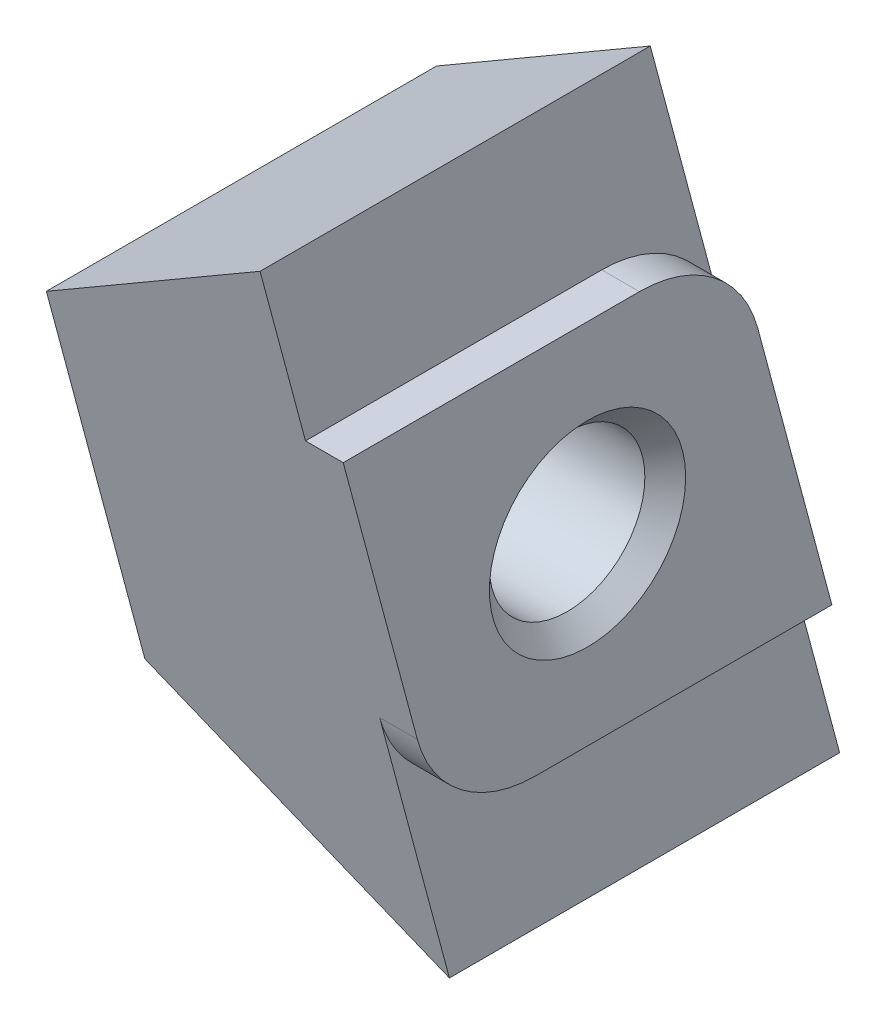
ISO-10303-21;
HEADER;
FILE_DESCRIPTION(('STEP AP214'),'2;1');
FILE_NAME('part.step','',(''),(''),'','','');
FILE_SCHEMA(('AUTOMOTIVE_DESIGN { 1 0 10303 214 1 1 1 1 }'));
ENDSEC;
DATA;
#1=APPLICATION_CONTEXT('core data for automotive mechanical design processes');
#2=APPLICATION_PROTOCOL_DEFINITION('international standard','automotive_design',2000,#1);
#3=PRODUCT_CONTEXT('',#1,'mechanical');
#4=PRODUCT('Part','Part','',(#3));
#5=PRODUCT_RELATED_PRODUCT_CATEGORY('part','',(#4));
#6=PRODUCT_DEFINITION_FORMATION('','',#4);
#7=PRODUCT_DEFINITION_CONTEXT('part definition',#1,'design');
#8=PRODUCT_DEFINITION('design','',#6,#7);
#9=PRODUCT_DEFINITION_SHAPE('','',#8);
#10=(LENGTH_UNIT() NAMED_UNIT(*) SI_UNIT(.MILLI.,.METRE.));
#11=(NAMED_UNIT(*) PLANE_ANGLE_UNIT() SI_UNIT($,.RADIAN.));
#12=(NAMED_UNIT(*) SI_UNIT($,.STERADIAN.) SOLID_ANGLE_UNIT());
#13=UNCERTAINTY_MEASURE_WITH_UNIT(LENGTH_MEASURE(1.E-05),#10,'distance_accuracy_value','');
#14=(GEOMETRIC_REPRESENTATION_CONTEXT(3) GLOBAL_UNCERTAINTY_ASSIGNED_CONTEXT((#13)) GLOBAL_UNIT_ASSIGNED_CONTEXT((#10,
#11,#12)) REPRESENTATION_CONTEXT('',''));
#15=CARTESIAN_POINT('',(0.,0.,0.));
#16=DIRECTION('',(0.,0.,1.));
#17=DIRECTION('',(1.,0.,0.));
#18=AXIS2_PLACEMENT_3D('',#15,#16,#17);
#19=CARTESIAN_POINT('',(-0.800000000000001,1.29999999999999,-1.10105270241365));
#20=DIRECTION('',(1.,0.,0.));
#21=DIRECTION('',(0.,0.,-1.));
#22=AXIS2_PLACEMENT_3D('',#19,#20,#21);
#23=CYLINDRICAL_SURFACE('',#22,2.60000000000001);
#24=CARTESIAN_POINT('',(0.,1.29999999999999,-1.10105270241365));
#25=DIRECTION('',(1.,0.,0.));
#26=DIRECTION('',(0.,0.,-1.));
#27=AXIS2_PLACEMENT_3D('',#24,#25,#26);
#28=CIRCLE('',#27,2.60000000000001);
#29=CARTESIAN_POINT('',(0.,1.97292951726655,-3.61245985076524));
#30=VERTEX_POINT('',#29);
#31=CARTESIAN_POINT('',(0.,3.9,-1.10105270241365));
#32=VERTEX_POINT('',#31);
#33=EDGE_CURVE('E152',#30,#32,#28,.T.);
#34=ORIENTED_EDGE('',*,*,#33,.F.);
#35=DIRECTION('',(1.,0.,0.));
#36=VECTOR('',#35,1.);
#37=CARTESIAN_POINT('',(-0.800000000000001,1.97292951726655,-3.61245985076524));
#38=LINE('',#37,#36);
#39=CARTESIAN_POINT('',(-0.800000000000001,1.97292951726655,-3.61245985076523));
#40=VERTEX_POINT('',#39);
#41=EDGE_CURVE('E170',#40,#30,#38,.T.);
#42=ORIENTED_EDGE('',*,*,#41,.F.);
#43=CARTESIAN_POINT('',(-0.800000000000001,1.29999999999999,-1.10105270241365));
#44=DIRECTION('',(1.,0.,0.));
#45=DIRECTION('',(0.,0.,-1.));
#46=AXIS2_PLACEMENT_3D('',#43,#44,#45);
#47=CIRCLE('',#46,2.60000000000001);
#48=CARTESIAN_POINT('',(-0.800000000000001,3.9,-1.10105270241365));
#49=VERTEX_POINT('',#48);
#50=EDGE_CURVE('E138',#40,#49,#47,.T.);
#51=ORIENTED_EDGE('',*,*,#50,.T.);
#52=DIRECTION('',(1.,0.,0.));
#53=VECTOR('',#52,1.);
#54=CARTESIAN_POINT('',(-0.800000000000001,3.9,-1.10105270241365));
#55=LINE('',#54,#53);
#56=EDGE_CURVE('E122',#49,#32,#55,.T.);
#57=ORIENTED_EDGE('',*,*,#56,.T.);
#58=EDGE_LOOP('',(#34,#42,#51,#57));
#59=FACE_BOUND('',#58,.T.);
#60=ADVANCED_FACE('F35',(#59),#23,.T.);
#61=CARTESIAN_POINT('',(-0.800000000000001,-3.9,-5.18610657212171));
#62=DIRECTION('',(0.,0.25881904510252,-0.965925826289068));
#63=DIRECTION('',(0.,0.965925826289068,0.25881904510252));
#64=AXIS2_PLACEMENT_3D('',#61,#62,#63);
#65=PLANE('',#64);
#66=DIRECTION('',(0.,0.965925826289068,0.25881904510252));
#67=VECTOR('',#66,1.);
#68=CARTESIAN_POINT('',(0.,-3.9,-5.18610657212171));
#69=LINE('',#68,#67);
#70=CARTESIAN_POINT('',(0.,-3.9,-5.18610657212171));
#71=VERTEX_POINT('',#70);
#72=EDGE_CURVE('E276',#71,#30,#69,.T.);
#73=ORIENTED_EDGE('',*,*,#72,.F.);
#74=DIRECTION('',(1.,0.,0.));
#75=VECTOR('',#74,1.);
#76=CARTESIAN_POINT('',(-0.800000000000001,-3.9,-5.18610657212171));
#77=LINE('',#76,#75);
#78=CARTESIAN_POINT('',(-0.800000000000001,-3.9,-5.18610657212171));
#79=VERTEX_POINT('',#78);
#80=EDGE_CURVE('E132',#79,#71,#77,.T.);
#81=ORIENTED_EDGE('',*,*,#80,.F.);
#82=CARTESIAN_POINT('',(-0.800000000000001,7.5,-2.13148577840691));
#83=CARTESIAN_POINT('',(-0.800000000000001,2.5,-3.47123174056252));
#84=CARTESIAN_POINT('',(-0.800000000000001,-2.5,-4.81097770271814));
#85=CARTESIAN_POINT('',(-0.800000000000001,-7.5,-6.15072366487375));
#86=B_SPLINE_CURVE_WITH_KNOTS('',3,(#82,#83,#84,#85),.UNSPECIFIED.,.F.,.F.,(4,4),(0.,1.),.UNSPECIFIED.);
#87=CARTESIAN_POINT('',(-0.800000000000001,-7.5,-6.15072366487375));
#88=VERTEX_POINT('',#87);
#89=EDGE_CURVE('E119',#79,#88,#86,.T.);
#90=ORIENTED_EDGE('',*,*,#89,.T.);
#91=DIRECTION('',(-0.827835666345006,0.541856072516727,0.145189897044757));
#92=VECTOR('',#91,1.);
#93=CARTESIAN_POINT('',(-2.53078460239917,-6.36712280570237,-5.84717013553806));
#94=LINE('',#93,#92);
#95=CARTESIAN_POINT('',(-6.3,-3.90000000000003,-5.18610657212172));
#96=VERTEX_POINT('',#95);
#97=EDGE_CURVE('E159',#96,#88,#94,.F.);
#98=ORIENTED_EDGE('',*,*,#97,.F.);
#99=CARTESIAN_POINT('',(-6.3,7.5,-2.13148577840691));
#100=CARTESIAN_POINT('',(-6.3,2.5,-3.47123174056252));
#101=CARTESIAN_POINT('',(-6.3,-2.5,-4.81097770271814));
#102=CARTESIAN_POINT('',(-6.3,-7.5,-6.15072366487375));
#103=B_SPLINE_CURVE_WITH_KNOTS('',3,(#99,#100,#101,#102),.UNSPECIFIED.,.F.,.F.,(4,4),(0.,1.),.UNSPECIFIED.);
#104=CARTESIAN_POINT('',(-6.3,3.90000000000003,-3.09610287115894));
#105=VERTEX_POINT('',#104);
#106=EDGE_CURVE('E86',#105,#96,#103,.T.);
#107=ORIENTED_EDGE('',*,*,#106,.F.);
#108=DIRECTION('',(-0.827835666345006,-0.541856072516727,-0.145189897044757));
#109=VECTOR('',#108,1.);
#110=CARTESIAN_POINT('',(-0.8,7.5,-2.13148577840691));
#111=LINE('',#110,#109);
#112=CARTESIAN_POINT('',(-0.800000000000001,7.5,-2.13148577840691));
#113=VERTEX_POINT('',#112);
#114=EDGE_CURVE('E153',#105,#113,#111,.F.);
#115=ORIENTED_EDGE('',*,*,#114,.T.);
#116=EDGE_CURVE('E226',#113,#40,#86,.T.);
#117=ORIENTED_EDGE('',*,*,#116,.T.);
#118=ORIENTED_EDGE('',*,*,#41,.T.);
#119=EDGE_LOOP('',(#73,#81,#90,#98,#107,#115,#117,#118));
#120=FACE_BOUND('',#119,.T.);
#121=ADVANCED_FACE('F196',(#120),#65,.T.);
#122=CARTESIAN_POINT('',(-0.800000000000001,-3.9,1.10105270241365));
#123=DIRECTION('',(0.,-1.,0.));
#124=DIRECTION('',(0.,0.,-1.));
#125=AXIS2_PLACEMENT_3D('',#122,#123,#124);
#126=PLANE('',#125);
#127=DIRECTION('',(0.,0.,-1.));
#128=VECTOR('',#127,1.);
#129=CARTESIAN_POINT('',(0.,-3.9,1.10105270241365));
#130=LINE('',#129,#128);
#131=CARTESIAN_POINT('',(0.,-3.9,1.10105270241365));
#132=VERTEX_POINT('',#131);
#133=EDGE_CURVE('E128',#132,#71,#130,.T.);
#134=ORIENTED_EDGE('',*,*,#133,.F.);
#135=DIRECTION('',(1.,0.,0.));
#136=VECTOR('',#135,1.);
#137=CARTESIAN_POINT('',(-0.800000000000001,-3.9,1.10105270241365));
#138=LINE('',#137,#136);
#139=CARTESIAN_POINT('',(-0.800000000000001,-3.9,1.10105270241365));
#140=VERTEX_POINT('',#139);
#141=EDGE_CURVE('E125',#140,#132,#138,.T.);
#142=ORIENTED_EDGE('',*,*,#141,.F.);
#143=DIRECTION('',(0.,0.,-1.));
#144=VECTOR('',#143,1.);
#145=CARTESIAN_POINT('',(-0.800000000000001,-3.9,1.10105270241365));
#146=LINE('',#145,#144);
#147=EDGE_CURVE('E114',#140,#79,#146,.T.);
#148=ORIENTED_EDGE('',*,*,#147,.T.);
#149=ORIENTED_EDGE('',*,*,#80,.T.);
#150=EDGE_LOOP('',(#134,#142,#148,#149));
#151=FACE_BOUND('',#150,.T.);
#152=ADVANCED_FACE('F126',(#151),#126,.T.);
#153=CARTESIAN_POINT('',(-0.800000000000001,-1.3,1.10105270241365));
#154=DIRECTION('',(1.,0.,0.));
#155=DIRECTION('',(0.,0.,-1.));
#156=AXIS2_PLACEMENT_3D('',#153,#154,#155);
#157=CYLINDRICAL_SURFACE('',#156,2.6);
#158=CARTESIAN_POINT('',(0.,-1.3,1.10105270241365));
#159=DIRECTION('',(1.,0.,0.));
#160=DIRECTION('',(0.,0.,-1.));
#161=AXIS2_PLACEMENT_3D('',#158,#159,#160);
#162=CIRCLE('',#161,2.6);
#163=CARTESIAN_POINT('',(0.,-1.97292951726655,3.61245985076523));
#164=VERTEX_POINT('',#163);
#165=EDGE_CURVE('E290',#164,#132,#162,.T.);
#166=ORIENTED_EDGE('',*,*,#165,.F.);
#167=DIRECTION('',(1.,0.,0.));
#168=VECTOR('',#167,1.);
#169=CARTESIAN_POINT('',(-0.800000000000001,-1.97292951726655,3.61245985076523));
#170=LINE('',#169,#168);
#171=CARTESIAN_POINT('',(-0.800000000000001,-1.97292951726656,3.61245985076523));
#172=VERTEX_POINT('',#171);
#173=EDGE_CURVE('E133',#172,#164,#170,.T.);
#174=ORIENTED_EDGE('',*,*,#173,.F.);
#175=CARTESIAN_POINT('',(-0.800000000000001,-1.3,1.10105270241365));
#176=DIRECTION('',(1.,0.,0.));
#177=DIRECTION('',(0.,0.,-1.));
#178=AXIS2_PLACEMENT_3D('',#175,#176,#177);
#179=CIRCLE('',#178,2.6);
#180=EDGE_CURVE('E100',#172,#140,#179,.T.);
#181=ORIENTED_EDGE('',*,*,#180,.T.);
#182=ORIENTED_EDGE('',*,*,#141,.T.);
#183=EDGE_LOOP('',(#166,#174,#181,#182));
#184=FACE_BOUND('',#183,.T.);
#185=ADVANCED_FACE('F136',(#184),#157,.T.);
#186=CARTESIAN_POINT('',(-0.800000000000001,3.9,5.18610657212171));
#187=DIRECTION('',(0.,-0.258819045102521,0.965925826289068));
#188=DIRECTION('',(0.,-0.965925826289068,-0.258819045102521));
#189=AXIS2_PLACEMENT_3D('',#186,#187,#188);
#190=PLANE('',#189);
#191=DIRECTION('',(0.,-0.965925826289068,-0.258819045102521));
#192=VECTOR('',#191,1.);
#193=CARTESIAN_POINT('',(0.,3.9,5.18610657212171));
#194=LINE('',#193,#192);
#195=CARTESIAN_POINT('',(0.,3.9,5.18610657212171));
#196=VERTEX_POINT('',#195);
#197=EDGE_CURVE('E296',#196,#164,#194,.T.);
#198=ORIENTED_EDGE('',*,*,#197,.F.);
#199=DIRECTION('',(1.,0.,0.));
#200=VECTOR('',#199,1.);
#201=CARTESIAN_POINT('',(-0.800000000000001,3.9,5.18610657212171));
#202=LINE('',#201,#200);
#203=CARTESIAN_POINT('',(-0.800000000000001,3.9,5.18610657212171));
#204=VERTEX_POINT('',#203);
#205=EDGE_CURVE('E146',#204,#196,#202,.T.);
#206=ORIENTED_EDGE('',*,*,#205,.F.);
#207=CARTESIAN_POINT('',(-0.800000000000001,-7.5,2.13148577840691));
#208=CARTESIAN_POINT('',(-0.800000000000001,-2.5,3.47123174056252));
#209=CARTESIAN_POINT('',(-0.800000000000001,2.5,4.81097770271814));
#210=CARTESIAN_POINT('',(-0.800000000000001,7.5,6.15072366487375));
#211=B_SPLINE_CURVE_WITH_KNOTS('',3,(#207,#208,#209,#210),.UNSPECIFIED.,.F.,.F.,(4,4),(0.,1.),.UNSPECIFIED.);
#212=CARTESIAN_POINT('',(-0.800000000000001,7.5,6.15072366487375));
#213=VERTEX_POINT('',#212);
#214=EDGE_CURVE('E52',#204,#213,#211,.T.);
#215=ORIENTED_EDGE('',*,*,#214,.T.);
#216=DIRECTION('',(-0.827835666345006,-0.541856072516727,-0.145189897044757));
#217=VECTOR('',#216,1.);
#218=CARTESIAN_POINT('',(-2.53078460239917,6.36712280570237,5.84717013553807));
#219=LINE('',#218,#217);
#220=CARTESIAN_POINT('',(-6.3,3.90000000000003,5.18610657212172));
#221=VERTEX_POINT('',#220);
#222=EDGE_CURVE('E149',#221,#213,#219,.F.);
#223=ORIENTED_EDGE('',*,*,#222,.F.);
#224=CARTESIAN_POINT('',(-6.3,-7.5,2.13148577840691));
#225=CARTESIAN_POINT('',(-6.3,-2.5,3.47123174056252));
#226=CARTESIAN_POINT('',(-6.3,2.5,4.81097770271814));
#227=CARTESIAN_POINT('',(-6.3,7.5,6.15072366487375));
#228=B_SPLINE_CURVE_WITH_KNOTS('',3,(#224,#225,#226,#227),.UNSPECIFIED.,.F.,.F.,(4,4),(0.,1.),.UNSPECIFIED.);
#229=CARTESIAN_POINT('',(-6.3,-3.90000000000003,3.09610287115894));
#230=VERTEX_POINT('',#229);
#231=EDGE_CURVE('E156',#230,#221,#228,.T.);
#232=ORIENTED_EDGE('',*,*,#231,.F.);
#233=DIRECTION('',(-0.827835666345006,0.541856072516727,0.145189897044757));
#234=VECTOR('',#233,1.);
#235=CARTESIAN_POINT('',(-0.800000000000001,-7.5,2.1314857784069));
#236=LINE('',#235,#234);
#237=CARTESIAN_POINT('',(-0.800000000000001,-7.5,2.13148577840691));
#238=VERTEX_POINT('',#237);
#239=EDGE_CURVE('E162',#230,#238,#236,.F.);
#240=ORIENTED_EDGE('',*,*,#239,.T.);
#241=EDGE_CURVE('E231',#238,#172,#211,.T.);
#242=ORIENTED_EDGE('',*,*,#241,.T.);
#243=ORIENTED_EDGE('',*,*,#173,.T.);
#244=EDGE_LOOP('',(#198,#206,#215,#223,#232,#240,#242,#243));
#245=FACE_BOUND('',#244,.T.);
#246=ADVANCED_FACE('F230',(#245),#190,.T.);
#247=CARTESIAN_POINT('',(-0.800000000000001,3.9,-1.10105270241365));
#248=DIRECTION('',(0.,1.,0.));
#249=DIRECTION('',(0.,0.,1.));
#250=AXIS2_PLACEMENT_3D('',#247,#248,#249);
#251=PLANE('',#250);
#252=DIRECTION('',(0.,0.,1.));
#253=VECTOR('',#252,1.);
#254=CARTESIAN_POINT('',(0.,3.9,-1.10105270241365));
#255=LINE('',#254,#253);
#256=EDGE_CURVE('E294',#32,#196,#255,.T.);
#257=ORIENTED_EDGE('',*,*,#256,.F.);
#258=ORIENTED_EDGE('',*,*,#56,.F.);
#259=DIRECTION('',(0.,0.,1.));
#260=VECTOR('',#259,1.);
#261=CARTESIAN_POINT('',(-0.800000000000001,3.9,-1.10105270241365));
#262=LINE('',#261,#260);
#263=EDGE_CURVE('E111',#49,#204,#262,.T.);
#264=ORIENTED_EDGE('',*,*,#263,.T.);
#265=ORIENTED_EDGE('',*,*,#205,.T.);
#266=EDGE_LOOP('',(#257,#258,#264,#265));
#267=FACE_BOUND('',#266,.T.);
#268=ADVANCED_FACE('F207',(#267),#251,.T.);
#269=CARTESIAN_POINT('',(0.,1.29999999999999,-1.10105270241365));
#270=DIRECTION('',(1.,0.,0.));
#271=DIRECTION('',(0.,0.,-1.));
#272=AXIS2_PLACEMENT_3D('',#269,#270,#271);
#273=PLANE('',#272);
#274=CARTESIAN_POINT('',(0.,0.,0.));
#275=DIRECTION('',(1.,0.,0.));
#276=DIRECTION('',(0.,0.,-1.));
#277=AXIS2_PLACEMENT_3D('',#274,#275,#276);
#278=CIRCLE('',#277,2.08299999999966);
#279=CARTESIAN_POINT('',(0.,0.,-2.08299999999966));
#280=VERTEX_POINT('',#279);
#281=EDGE_CURVE('E44',#280,#280,#278,.F.);
#282=ORIENTED_EDGE('',*,*,#281,.T.);
#283=EDGE_LOOP('',(#282));
#284=FACE_BOUND('',#283,.T.);
#285=ORIENTED_EDGE('',*,*,#33,.T.);
#286=ORIENTED_EDGE('',*,*,#256,.T.);
#287=ORIENTED_EDGE('',*,*,#197,.T.);
#288=ORIENTED_EDGE('',*,*,#165,.T.);
#289=ORIENTED_EDGE('',*,*,#133,.T.);
#290=ORIENTED_EDGE('',*,*,#72,.T.);
#291=EDGE_LOOP('',(#285,#286,#287,#288,#289,#290));
#292=FACE_BOUND('',#291,.T.);
#293=ADVANCED_FACE('F175',(#284,#292),#273,.T.);
#294=CARTESIAN_POINT('',(-0.800000000000001,0.,4.14110472164033));
#295=DIRECTION('',(-1.,0.,0.));
#296=DIRECTION('',(0.,0.,1.));
#297=AXIS2_PLACEMENT_3D('',#294,#295,#296);
#298=PLANE('',#297);
#299=ORIENTED_EDGE('',*,*,#147,.F.);
#300=ORIENTED_EDGE('',*,*,#180,.F.);
#301=ORIENTED_EDGE('',*,*,#241,.F.);
#302=DIRECTION('',(0.,0.,1.));
#303=VECTOR('',#302,1.);
#304=CARTESIAN_POINT('',(-0.800000000000001,-7.5,2.13148577840691));
#305=LINE('',#304,#303);
#306=EDGE_CURVE('E223',#88,#238,#305,.T.);
#307=ORIENTED_EDGE('',*,*,#306,.F.);
#308=ORIENTED_EDGE('',*,*,#89,.F.);
#309=EDGE_LOOP('',(#299,#300,#301,#307,#308));
#310=FACE_BOUND('',#309,.T.);
#311=ADVANCED_FACE('F116',(#310),#298,.F.);
#312=CARTESIAN_POINT('',(-0.800000000000001,7.5,-2.13148577840691));
#313=DIRECTION('',(-0.547659174694385,0.836701516894206,0.));
#314=DIRECTION('',(-0.836701516894206,-0.547659174694385,0.));
#315=AXIS2_PLACEMENT_3D('',#312,#313,#314);
#316=PLANE('',#315);
#317=DIRECTION('',(0.,0.,-1.));
#318=VECTOR('',#317,1.);
#319=CARTESIAN_POINT('',(-0.800000000000001,7.5,-2.13148577840691));
#320=LINE('',#319,#318);
#321=EDGE_CURVE('E233',#213,#113,#320,.T.);
#322=ORIENTED_EDGE('',*,*,#321,.T.);
#323=ORIENTED_EDGE('',*,*,#114,.F.);
#324=DIRECTION('',(0.,0.,1.));
#325=VECTOR('',#324,1.);
#326=CARTESIAN_POINT('',(-6.3,3.90000000000003,-2.13148577840691));
#327=LINE('',#326,#325);
#328=EDGE_CURVE('E154',#221,#105,#327,.F.);
#329=ORIENTED_EDGE('',*,*,#328,.F.);
#330=ORIENTED_EDGE('',*,*,#222,.T.);
#331=EDGE_LOOP('',(#322,#323,#329,#330));
#332=FACE_BOUND('',#331,.T.);
#333=ADVANCED_FACE('F209',(#332),#316,.T.);
#334=CARTESIAN_POINT('',(-0.800000000000001,-7.5,2.13148577840691));
#335=DIRECTION('',(-0.547659174694385,-0.836701516894206,0.));
#336=DIRECTION('',(0.836701516894206,-0.547659174694385,0.));
#337=AXIS2_PLACEMENT_3D('',#334,#335,#336);
#338=PLANE('',#337);
#339=ORIENTED_EDGE('',*,*,#306,.T.);
#340=ORIENTED_EDGE('',*,*,#239,.F.);
#341=DIRECTION('',(0.,0.,-1.));
#342=VECTOR('',#341,1.);
#343=CARTESIAN_POINT('',(-6.3,-3.90000000000003,2.13148577840691));
#344=LINE('',#343,#342);
#345=EDGE_CURVE('E91',#96,#230,#344,.F.);
#346=ORIENTED_EDGE('',*,*,#345,.F.);
#347=ORIENTED_EDGE('',*,*,#97,.T.);
#348=EDGE_LOOP('',(#339,#340,#346,#347));
#349=FACE_BOUND('',#348,.T.);
#350=ADVANCED_FACE('F212',(#349),#338,.T.);
#351=CARTESIAN_POINT('',(-6.3,0.,4.14110472164033));
#352=DIRECTION('',(-1.,0.,0.));
#353=DIRECTION('',(0.,0.,1.));
#354=AXIS2_PLACEMENT_3D('',#351,#352,#353);
#355=PLANE('',#354);
#356=CARTESIAN_POINT('',(-6.3,0.,0.));
#357=DIRECTION('',(-1.,0.,0.));
#358=DIRECTION('',(0.,0.,1.));
#359=AXIS2_PLACEMENT_3D('',#356,#357,#358);
#360=CIRCLE('',#359,2.08299999999966);
#361=CARTESIAN_POINT('',(-6.3,0.,2.08299999999966));
#362=VERTEX_POINT('',#361);
#363=EDGE_CURVE('E11',#362,#362,#360,.F.);
#364=ORIENTED_EDGE('',*,*,#363,.T.);
#365=EDGE_LOOP('',(#364));
#366=FACE_BOUND('',#365,.T.);
#367=ORIENTED_EDGE('',*,*,#231,.T.);
#368=ORIENTED_EDGE('',*,*,#328,.T.);
#369=ORIENTED_EDGE('',*,*,#106,.T.);
#370=ORIENTED_EDGE('',*,*,#345,.T.);
#371=EDGE_LOOP('',(#367,#368,#369,#370));
#372=FACE_BOUND('',#371,.T.);
#373=ADVANCED_FACE('F215',(#366,#372),#355,.T.);
#374=ORIENTED_EDGE('',*,*,#50,.F.);
#375=ORIENTED_EDGE('',*,*,#116,.F.);
#376=ORIENTED_EDGE('',*,*,#321,.F.);
#377=ORIENTED_EDGE('',*,*,#214,.F.);
#378=ORIENTED_EDGE('',*,*,#263,.F.);
#379=EDGE_LOOP('',(#374,#375,#376,#377,#378));
#380=FACE_BOUND('',#379,.T.);
#381=ADVANCED_FACE('F186',(#380),#298,.F.);
#382=CARTESIAN_POINT('',(-6.3,0.,0.));
#383=DIRECTION('',(-1.,0.,0.));
#384=DIRECTION('',(0.,0.,1.));
#385=AXIS2_PLACEMENT_3D('',#382,#383,#384);
#386=CYLINDRICAL_SURFACE('',#385,1.65);
#387=CARTESIAN_POINT('',(-0.43299999999966,0.,0.));
#388=DIRECTION('',(1.,0.,0.));
#389=DIRECTION('',(0.,0.,-1.));
#390=AXIS2_PLACEMENT_3D('',#387,#388,#389);
#391=CIRCLE('',#390,1.65);
#392=CARTESIAN_POINT('',(-0.43299999999966,0.,-1.65));
#393=VERTEX_POINT('',#392);
#394=EDGE_CURVE('E169',#393,#393,#391,.T.);
#395=ORIENTED_EDGE('',*,*,#394,.T.);
#396=EDGE_LOOP('',(#395));
#397=FACE_BOUND('',#396,.T.);
#398=CARTESIAN_POINT('',(-5.86700000000034,0.,0.));
#399=DIRECTION('',(-1.,0.,0.));
#400=DIRECTION('',(0.,0.,1.));
#401=AXIS2_PLACEMENT_3D('',#398,#399,#400);
#402=CIRCLE('',#401,1.65);
#403=CARTESIAN_POINT('',(-5.86700000000034,0.,1.65));
#404=VERTEX_POINT('',#403);
#405=EDGE_CURVE('E166',#404,#404,#402,.T.);
#406=ORIENTED_EDGE('',*,*,#405,.T.);
#407=EDGE_LOOP('',(#406));
#408=FACE_BOUND('',#407,.T.);
#409=ADVANCED_FACE('F181',(#397,#408),#386,.F.);
#410=CARTESIAN_POINT('',(-0.43299999999966,0.,0.));
#411=DIRECTION('',(1.,0.,0.));
#412=DIRECTION('',(0.,0.,-1.));
#413=AXIS2_PLACEMENT_3D('',#410,#411,#412);
#414=CONICAL_SURFACE('',#413,1.65,0.785398163397451);
#415=ORIENTED_EDGE('',*,*,#281,.F.);
#416=EDGE_LOOP('',(#415));
#417=FACE_BOUND('',#416,.T.);
#418=ORIENTED_EDGE('',*,*,#394,.F.);
#419=EDGE_LOOP('',(#418));
#420=FACE_BOUND('',#419,.T.);
#421=ADVANCED_FACE('F178',(#417,#420),#414,.F.);
#422=CARTESIAN_POINT('',(-5.86700000000034,0.,0.));
#423=DIRECTION('',(-1.,0.,0.));
#424=DIRECTION('',(0.,0.,1.));
#425=AXIS2_PLACEMENT_3D('',#422,#423,#424);
#426=CONICAL_SURFACE('',#425,1.65,0.785398163397452);
#427=ORIENTED_EDGE('',*,*,#363,.F.);
#428=EDGE_LOOP('',(#427));
#429=FACE_BOUND('',#428,.T.);
#430=ORIENTED_EDGE('',*,*,#405,.F.);
#431=EDGE_LOOP('',(#430));
#432=FACE_BOUND('',#431,.T.);
#433=ADVANCED_FACE('F37',(#429,#432),#426,.F.);
#434=CLOSED_SHELL('',(#60,#121,#152,#185,#246,#268,#293,#311,#333,#350,#373,#381,#409,#421,#433));
#435=MANIFOLD_SOLID_BREP('B2',#434);
#436=ADVANCED_BREP_SHAPE_REPRESENTATION('',(#18,#435),#14);
#437=SHAPE_DEFINITION_REPRESENTATION(#9,#436);
ENDSEC;
END-ISO-10303-21;
